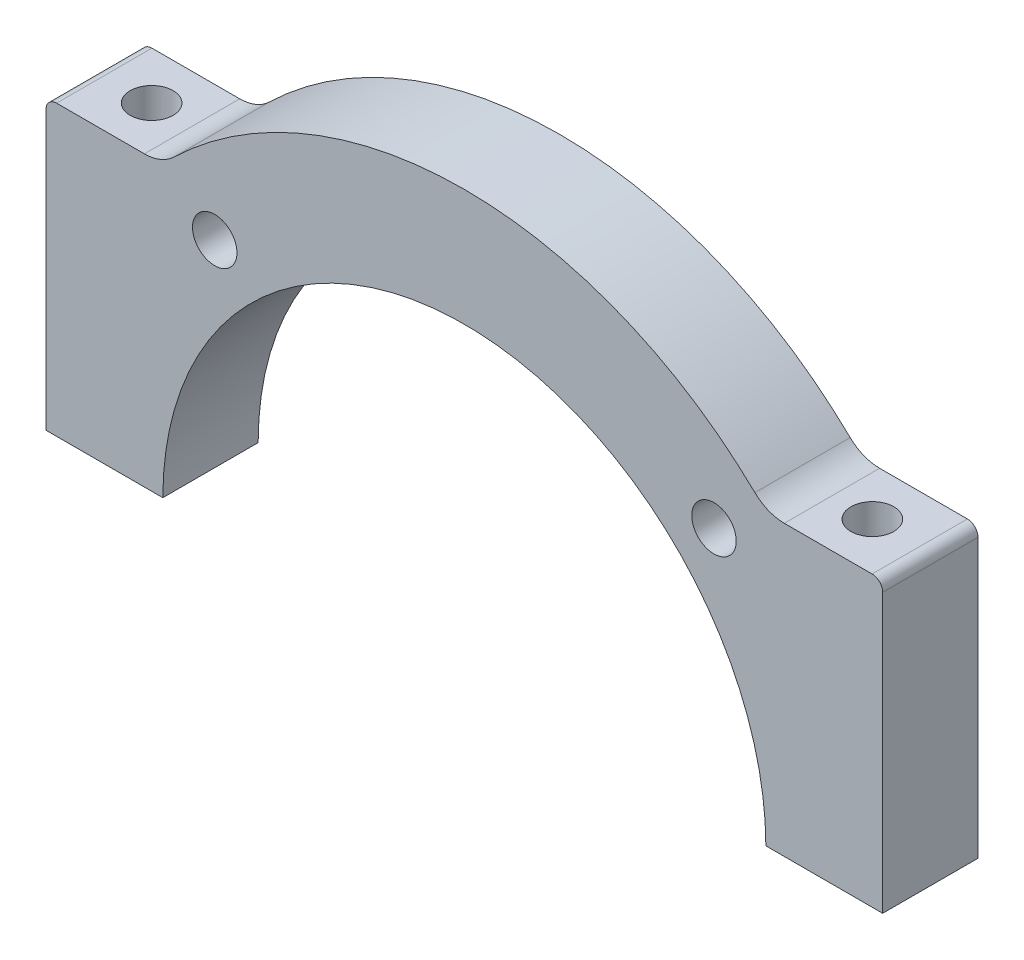
ISO-10303-21;
HEADER;
FILE_DESCRIPTION(('STEP AP214'),'2;1');
FILE_NAME('part.step','',(''),(''),'','','');
FILE_SCHEMA(('AUTOMOTIVE_DESIGN { 1 0 10303 214 1 1 1 1 }'));
ENDSEC;
DATA;
#1=APPLICATION_CONTEXT('core data for automotive mechanical design processes');
#2=APPLICATION_PROTOCOL_DEFINITION('international standard','automotive_design',2000,#1);
#3=PRODUCT_CONTEXT('',#1,'mechanical');
#4=PRODUCT('Part','Part','',(#3));
#5=PRODUCT_RELATED_PRODUCT_CATEGORY('part','',(#4));
#6=PRODUCT_DEFINITION_FORMATION('','',#4);
#7=PRODUCT_DEFINITION_CONTEXT('part definition',#1,'design');
#8=PRODUCT_DEFINITION('design','',#6,#7);
#9=PRODUCT_DEFINITION_SHAPE('','',#8);
#10=(LENGTH_UNIT() NAMED_UNIT(*) SI_UNIT(.MILLI.,.METRE.));
#11=(NAMED_UNIT(*) PLANE_ANGLE_UNIT() SI_UNIT($,.RADIAN.));
#12=(NAMED_UNIT(*) SI_UNIT($,.STERADIAN.) SOLID_ANGLE_UNIT());
#13=UNCERTAINTY_MEASURE_WITH_UNIT(LENGTH_MEASURE(1.E-05),#10,'distance_accuracy_value','');
#14=(GEOMETRIC_REPRESENTATION_CONTEXT(3) GLOBAL_UNCERTAINTY_ASSIGNED_CONTEXT((#13)) GLOBAL_UNIT_ASSIGNED_CONTEXT((#10,
#11,#12)) REPRESENTATION_CONTEXT('',''));
#15=CARTESIAN_POINT('',(0.,0.,0.));
#16=DIRECTION('',(0.,0.,1.));
#17=DIRECTION('',(1.,0.,0.));
#18=AXIS2_PLACEMENT_3D('',#15,#16,#17);
#19=CARTESIAN_POINT('',(-34.025,131.45295340565,4.5));
#20=DIRECTION('',(0.,-1.,0.));
#21=DIRECTION('',(1.,0.,0.));
#22=AXIS2_PLACEMENT_3D('',#19,#20,#21);
#23=CYLINDRICAL_SURFACE('',#22,2.025);
#24=CARTESIAN_POINT('',(-34.025,0.0499999999999945,4.5));
#25=DIRECTION('',(0.,-1.,0.));
#26=DIRECTION('',(0.,0.,1.));
#27=AXIS2_PLACEMENT_3D('',#24,#25,#26);
#28=CIRCLE('',#27,2.025);
#29=CARTESIAN_POINT('',(-34.025,0.0499999999999945,6.525));
#30=VERTEX_POINT('',#29);
#31=EDGE_CURVE('E222',#30,#30,#28,.T.);
#32=ORIENTED_EDGE('',*,*,#31,.T.);
#33=EDGE_LOOP('',(#32));
#34=FACE_BOUND('',#33,.T.);
#35=CARTESIAN_POINT('',(-34.025,27.2973899851249,4.5));
#36=DIRECTION('',(0.,-1.,0.));
#37=DIRECTION('',(0.,0.,1.));
#38=AXIS2_PLACEMENT_3D('',#35,#36,#37);
#39=CIRCLE('',#38,2.025);
#40=CARTESIAN_POINT('',(-34.025,27.2973899851249,6.525));
#41=VERTEX_POINT('',#40);
#42=EDGE_CURVE('E192',#41,#41,#39,.T.);
#43=ORIENTED_EDGE('',*,*,#42,.F.);
#44=EDGE_LOOP('',(#43));
#45=FACE_BOUND('',#44,.T.);
#46=ADVANCED_FACE('F16',(#34,#45),#23,.F.);
#47=CARTESIAN_POINT('',(34.025,131.45295340565,4.5));
#48=DIRECTION('',(0.,-1.,0.));
#49=DIRECTION('',(1.,0.,0.));
#50=AXIS2_PLACEMENT_3D('',#47,#48,#49);
#51=CYLINDRICAL_SURFACE('',#50,2.025);
#52=CARTESIAN_POINT('',(34.025,27.2973899851249,4.5));
#53=DIRECTION('',(0.,1.,0.));
#54=DIRECTION('',(0.,0.,-1.));
#55=AXIS2_PLACEMENT_3D('',#52,#53,#54);
#56=CIRCLE('',#55,2.025);
#57=CARTESIAN_POINT('',(34.025,27.2973899851249,2.475));
#58=VERTEX_POINT('',#57);
#59=EDGE_CURVE('E231',#58,#58,#56,.T.);
#60=ORIENTED_EDGE('',*,*,#59,.T.);
#61=EDGE_LOOP('',(#60));
#62=FACE_BOUND('',#61,.T.);
#63=CARTESIAN_POINT('',(34.025,0.0499999999999945,4.5));
#64=DIRECTION('',(0.,1.,0.));
#65=DIRECTION('',(1.,0.,0.));
#66=AXIS2_PLACEMENT_3D('',#63,#64,#65);
#67=CIRCLE('',#66,2.025);
#68=CARTESIAN_POINT('',(36.05,0.0499999999999948,4.5));
#69=VERTEX_POINT('',#68);
#70=EDGE_CURVE('E128',#69,#69,#67,.T.);
#71=ORIENTED_EDGE('',*,*,#70,.F.);
#72=EDGE_LOOP('',(#71));
#73=FACE_BOUND('',#72,.T.);
#74=ADVANCED_FACE('F459',(#62,#73),#51,.F.);
#75=CARTESIAN_POINT('',(0.,-12.25,0.));
#76=DIRECTION('',(0.,0.,1.));
#77=DIRECTION('',(1.,0.,0.));
#78=AXIS2_PLACEMENT_3D('',#75,#76,#77);
#79=PLANE('',#78);
#80=CARTESIAN_POINT('',(23.57,23.57,0.));
#81=DIRECTION('',(0.,0.,1.));
#82=DIRECTION('',(1.,0.,0.));
#83=AXIS2_PLACEMENT_3D('',#80,#81,#82);
#84=CIRCLE('',#83,2.1);
#85=CARTESIAN_POINT('',(25.67,23.57,0.));
#86=VERTEX_POINT('',#85);
#87=EDGE_CURVE('E11',#86,#86,#84,.T.);
#88=ORIENTED_EDGE('',*,*,#87,.T.);
#89=EDGE_LOOP('',(#88));
#90=FACE_BOUND('',#89,.T.);
#91=CARTESIAN_POINT('',(-23.57,23.57,0.));
#92=DIRECTION('',(0.,0.,1.));
#93=DIRECTION('',(1.,0.,0.));
#94=AXIS2_PLACEMENT_3D('',#91,#92,#93);
#95=CIRCLE('',#94,2.1);
#96=CARTESIAN_POINT('',(-21.47,23.57,0.));
#97=VERTEX_POINT('',#96);
#98=EDGE_CURVE('E211',#97,#97,#95,.T.);
#99=ORIENTED_EDGE('',*,*,#98,.T.);
#100=EDGE_LOOP('',(#99));
#101=FACE_BOUND('',#100,.T.);
#102=DIRECTION('',(-1.,0.,0.));
#103=VECTOR('',#102,1.);
#104=CARTESIAN_POINT('',(34.3556402380938,27.2973899851249,0.));
#105=LINE('',#104,#103);
#106=CARTESIAN_POINT('',(38.4999683544177,27.2973899851249,0.));
#107=VERTEX_POINT('',#106);
#108=CARTESIAN_POINT('',(30.2113121217699,27.2973899851249,0.));
#109=VERTEX_POINT('',#108);
#110=EDGE_CURVE('E234',#107,#109,#105,.T.);
#111=ORIENTED_EDGE('',*,*,#110,.F.);
#112=CARTESIAN_POINT('',(38.4999683544177,26.2973899851249,0.));
#113=DIRECTION('',(0.,0.,-1.));
#114=DIRECTION('',(1.,0.,0.));
#115=AXIS2_PLACEMENT_3D('',#112,#113,#114);
#116=CIRCLE('',#115,1.);
#117=CARTESIAN_POINT('',(39.4999683544177,26.2973899851249,0.));
#118=VERTEX_POINT('',#117);
#119=EDGE_CURVE('E216',#107,#118,#116,.T.);
#120=ORIENTED_EDGE('',*,*,#119,.T.);
#121=DIRECTION('',(0.,1.,0.));
#122=VECTOR('',#121,1.);
#123=CARTESIAN_POINT('',(39.4999683544177,13.1736949925625,0.));
#124=LINE('',#123,#122);
#125=CARTESIAN_POINT('',(39.4999683544177,0.050000000002007,0.));
#126=VERTEX_POINT('',#125);
#127=EDGE_CURVE('E288',#126,#118,#124,.T.);
#128=ORIENTED_EDGE('',*,*,#127,.F.);
#129=DIRECTION('',(-1.,0.,0.));
#130=VECTOR('',#129,1.);
#131=CARTESIAN_POINT('',(34.0249622857735,0.05,0.));
#132=LINE('',#131,#130);
#133=CARTESIAN_POINT('',(28.4699560940084,0.05,0.));
#134=VERTEX_POINT('',#133);
#135=EDGE_CURVE('E271',#126,#134,#132,.T.);
#136=ORIENTED_EDGE('',*,*,#135,.T.);
#137=CARTESIAN_POINT('',(-9.1919527545059E-11,0.,0.));
#138=DIRECTION('',(0.,0.,1.));
#139=DIRECTION('',(1.,0.,0.));
#140=AXIS2_PLACEMENT_3D('',#137,#138,#139);
#141=CIRCLE('',#140,28.47);
#142=CARTESIAN_POINT('',(-28.4699560941923,0.05,0.));
#143=VERTEX_POINT('',#142);
#144=EDGE_CURVE('E245',#134,#143,#141,.T.);
#145=ORIENTED_EDGE('',*,*,#144,.T.);
#146=DIRECTION('',(1.,0.,0.));
#147=VECTOR('',#146,1.);
#148=CARTESIAN_POINT('',(-34.0249622857735,0.05,0.));
#149=LINE('',#148,#147);
#150=CARTESIAN_POINT('',(-39.4999683544177,0.0499999999976821,0.));
#151=VERTEX_POINT('',#150);
#152=EDGE_CURVE('E217',#151,#143,#149,.T.);
#153=ORIENTED_EDGE('',*,*,#152,.F.);
#154=DIRECTION('',(0.,1.,0.));
#155=VECTOR('',#154,1.);
#156=CARTESIAN_POINT('',(-39.4999683544177,13.1736949925625,0.));
#157=LINE('',#156,#155);
#158=CARTESIAN_POINT('',(-39.4999683544177,26.2973899851249,0.));
#159=VERTEX_POINT('',#158);
#160=EDGE_CURVE('E223',#151,#159,#157,.T.);
#161=ORIENTED_EDGE('',*,*,#160,.T.);
#162=CARTESIAN_POINT('',(-38.4999683544177,26.2973899851249,0.));
#163=DIRECTION('',(0.,0.,1.));
#164=DIRECTION('',(1.,0.,0.));
#165=AXIS2_PLACEMENT_3D('',#162,#163,#164);
#166=CIRCLE('',#165,1.00000000000002);
#167=CARTESIAN_POINT('',(-38.4999683544177,27.2973899851249,0.));
#168=VERTEX_POINT('',#167);
#169=EDGE_CURVE('E180',#168,#159,#166,.T.);
#170=ORIENTED_EDGE('',*,*,#169,.F.);
#171=DIRECTION('',(1.,0.,0.));
#172=VECTOR('',#171,1.);
#173=CARTESIAN_POINT('',(-34.3556402380938,27.2973899851249,0.));
#174=LINE('',#173,#172);
#175=CARTESIAN_POINT('',(-30.2113121217699,27.2973899851249,0.));
#176=VERTEX_POINT('',#175);
#177=EDGE_CURVE('E274',#168,#176,#174,.T.);
#178=ORIENTED_EDGE('',*,*,#177,.T.);
#179=CARTESIAN_POINT('',(-30.2113121217699,31.2973899851249,0.));
#180=DIRECTION('',(0.,0.,1.));
#181=DIRECTION('',(1.,0.,0.));
#182=AXIS2_PLACEMENT_3D('',#179,#180,#181);
#183=CIRCLE('',#182,4.);
#184=CARTESIAN_POINT('',(-27.4332604324117,28.4194690669526,0.));
#185=VERTEX_POINT('',#184);
#186=EDGE_CURVE('E195',#176,#185,#183,.T.);
#187=ORIENTED_EDGE('',*,*,#186,.T.);
#188=CARTESIAN_POINT('',(0.,0.,0.));
#189=DIRECTION('',(0.,0.,1.));
#190=DIRECTION('',(1.,0.,0.));
#191=AXIS2_PLACEMENT_3D('',#188,#189,#190);
#192=CIRCLE('',#191,39.5);
#193=CARTESIAN_POINT('',(27.4332604324117,28.4194690669526,0.));
#194=VERTEX_POINT('',#193);
#195=EDGE_CURVE('E20',#194,#185,#192,.T.);
#196=ORIENTED_EDGE('',*,*,#195,.F.);
#197=CARTESIAN_POINT('',(30.2113121217699,31.2973899851249,0.));
#198=DIRECTION('',(0.,0.,-1.));
#199=DIRECTION('',(1.,0.,0.));
#200=AXIS2_PLACEMENT_3D('',#197,#198,#199);
#201=CIRCLE('',#200,4.);
#202=EDGE_CURVE('E240',#109,#194,#201,.T.);
#203=ORIENTED_EDGE('',*,*,#202,.F.);
#204=EDGE_LOOP('',(#111,#120,#128,#136,#145,#153,#161,#170,#178,#187,#196,#203));
#205=FACE_BOUND('',#204,.T.);
#206=ADVANCED_FACE('F310',(#90,#101,#205),#79,.F.);
#207=CARTESIAN_POINT('',(0.,-12.25,9.));
#208=DIRECTION('',(0.,0.,1.));
#209=DIRECTION('',(1.,0.,0.));
#210=AXIS2_PLACEMENT_3D('',#207,#208,#209);
#211=PLANE('',#210);
#212=CARTESIAN_POINT('',(23.57,23.57,9.));
#213=DIRECTION('',(0.,0.,1.));
#214=DIRECTION('',(1.,0.,0.));
#215=AXIS2_PLACEMENT_3D('',#212,#213,#214);
#216=CIRCLE('',#215,2.1);
#217=CARTESIAN_POINT('',(25.67,23.57,9.));
#218=VERTEX_POINT('',#217);
#219=EDGE_CURVE('E27',#218,#218,#216,.T.);
#220=ORIENTED_EDGE('',*,*,#219,.F.);
#221=EDGE_LOOP('',(#220));
#222=FACE_BOUND('',#221,.T.);
#223=CARTESIAN_POINT('',(-23.57,23.57,9.));
#224=DIRECTION('',(0.,0.,1.));
#225=DIRECTION('',(1.,0.,0.));
#226=AXIS2_PLACEMENT_3D('',#223,#224,#225);
#227=CIRCLE('',#226,2.1);
#228=CARTESIAN_POINT('',(-21.47,23.57,9.));
#229=VERTEX_POINT('',#228);
#230=EDGE_CURVE('E207',#229,#229,#227,.T.);
#231=ORIENTED_EDGE('',*,*,#230,.F.);
#232=EDGE_LOOP('',(#231));
#233=FACE_BOUND('',#232,.T.);
#234=DIRECTION('',(-1.,0.,0.));
#235=VECTOR('',#234,1.);
#236=CARTESIAN_POINT('',(34.3556402380938,27.2973899851249,9.));
#237=LINE('',#236,#235);
#238=CARTESIAN_POINT('',(38.4999683544177,27.2973899851249,9.));
#239=VERTEX_POINT('',#238);
#240=CARTESIAN_POINT('',(30.2113121217699,27.2973899851249,9.));
#241=VERTEX_POINT('',#240);
#242=EDGE_CURVE('E246',#239,#241,#237,.T.);
#243=ORIENTED_EDGE('',*,*,#242,.T.);
#244=CARTESIAN_POINT('',(30.2113121217699,31.2973899851249,9.));
#245=DIRECTION('',(0.,0.,-1.));
#246=DIRECTION('',(1.,0.,0.));
#247=AXIS2_PLACEMENT_3D('',#244,#245,#246);
#248=CIRCLE('',#247,4.);
#249=CARTESIAN_POINT('',(27.4332604324117,28.4194690669526,9.));
#250=VERTEX_POINT('',#249);
#251=EDGE_CURVE('E239',#241,#250,#248,.T.);
#252=ORIENTED_EDGE('',*,*,#251,.T.);
#253=CARTESIAN_POINT('',(0.,0.,9.));
#254=DIRECTION('',(0.,0.,1.));
#255=DIRECTION('',(1.,0.,0.));
#256=AXIS2_PLACEMENT_3D('',#253,#254,#255);
#257=CIRCLE('',#256,39.5);
#258=CARTESIAN_POINT('',(-27.4332604324117,28.4194690669526,9.));
#259=VERTEX_POINT('',#258);
#260=EDGE_CURVE('E187',#250,#259,#257,.T.);
#261=ORIENTED_EDGE('',*,*,#260,.T.);
#262=CARTESIAN_POINT('',(-30.2113121217699,31.2973899851249,9.));
#263=DIRECTION('',(0.,0.,1.));
#264=DIRECTION('',(1.,0.,0.));
#265=AXIS2_PLACEMENT_3D('',#262,#263,#264);
#266=CIRCLE('',#265,4.);
#267=CARTESIAN_POINT('',(-30.2113121217699,27.2973899851249,9.));
#268=VERTEX_POINT('',#267);
#269=EDGE_CURVE('E183',#268,#259,#266,.T.);
#270=ORIENTED_EDGE('',*,*,#269,.F.);
#271=DIRECTION('',(1.,0.,0.));
#272=VECTOR('',#271,1.);
#273=CARTESIAN_POINT('',(-34.3556402380938,27.2973899851249,9.));
#274=LINE('',#273,#272);
#275=CARTESIAN_POINT('',(-38.4999683544177,27.2973899851249,9.));
#276=VERTEX_POINT('',#275);
#277=EDGE_CURVE('E167',#276,#268,#274,.T.);
#278=ORIENTED_EDGE('',*,*,#277,.F.);
#279=CARTESIAN_POINT('',(-38.4999683544177,26.2973899851249,9.));
#280=DIRECTION('',(0.,0.,1.));
#281=DIRECTION('',(1.,0.,0.));
#282=AXIS2_PLACEMENT_3D('',#279,#280,#281);
#283=CIRCLE('',#282,1.00000000000002);
#284=CARTESIAN_POINT('',(-39.4999683544177,26.2973899851249,9.));
#285=VERTEX_POINT('',#284);
#286=EDGE_CURVE('E227',#276,#285,#283,.T.);
#287=ORIENTED_EDGE('',*,*,#286,.T.);
#288=DIRECTION('',(0.,1.,0.));
#289=VECTOR('',#288,1.);
#290=CARTESIAN_POINT('',(-39.4999683544177,13.1736949925625,9.));
#291=LINE('',#290,#289);
#292=CARTESIAN_POINT('',(-39.4999683544177,0.0499999999976821,9.));
#293=VERTEX_POINT('',#292);
#294=EDGE_CURVE('E230',#293,#285,#291,.T.);
#295=ORIENTED_EDGE('',*,*,#294,.F.);
#296=DIRECTION('',(1.,0.,0.));
#297=VECTOR('',#296,1.);
#298=CARTESIAN_POINT('',(-34.0249622857735,0.05,9.));
#299=LINE('',#298,#297);
#300=CARTESIAN_POINT('',(-28.4699560941923,0.05,9.));
#301=VERTEX_POINT('',#300);
#302=EDGE_CURVE('E254',#293,#301,#299,.T.);
#303=ORIENTED_EDGE('',*,*,#302,.T.);
#304=CARTESIAN_POINT('',(-9.1919527545059E-11,0.,9.));
#305=DIRECTION('',(0.,0.,1.));
#306=DIRECTION('',(1.,0.,0.));
#307=AXIS2_PLACEMENT_3D('',#304,#305,#306);
#308=CIRCLE('',#307,28.47);
#309=CARTESIAN_POINT('',(28.4699560940084,0.05,9.));
#310=VERTEX_POINT('',#309);
#311=EDGE_CURVE('E244',#310,#301,#308,.T.);
#312=ORIENTED_EDGE('',*,*,#311,.F.);
#313=DIRECTION('',(-1.,0.,0.));
#314=VECTOR('',#313,1.);
#315=CARTESIAN_POINT('',(34.0249622857735,0.05,9.));
#316=LINE('',#315,#314);
#317=CARTESIAN_POINT('',(39.4999683544177,0.050000000002007,9.));
#318=VERTEX_POINT('',#317);
#319=EDGE_CURVE('E141',#318,#310,#316,.T.);
#320=ORIENTED_EDGE('',*,*,#319,.F.);
#321=DIRECTION('',(0.,1.,0.));
#322=VECTOR('',#321,1.);
#323=CARTESIAN_POINT('',(39.4999683544177,13.1736949925625,9.));
#324=LINE('',#323,#322);
#325=CARTESIAN_POINT('',(39.4999683544177,26.2973899851249,9.));
#326=VERTEX_POINT('',#325);
#327=EDGE_CURVE('E212',#318,#326,#324,.T.);
#328=ORIENTED_EDGE('',*,*,#327,.T.);
#329=CARTESIAN_POINT('',(38.4999683544177,26.2973899851249,9.));
#330=DIRECTION('',(0.,0.,-1.));
#331=DIRECTION('',(1.,0.,0.));
#332=AXIS2_PLACEMENT_3D('',#329,#330,#331);
#333=CIRCLE('',#332,1.);
#334=EDGE_CURVE('E286',#239,#326,#333,.T.);
#335=ORIENTED_EDGE('',*,*,#334,.F.);
#336=EDGE_LOOP('',(#243,#252,#261,#270,#278,#287,#295,#303,#312,#320,#328,#335));
#337=FACE_BOUND('',#336,.T.);
#338=ADVANCED_FACE('F185',(#222,#233,#337),#211,.T.);
#339=CARTESIAN_POINT('',(23.57,23.57,9.));
#340=DIRECTION('',(0.,0.,-1.));
#341=DIRECTION('',(-1.,0.,0.));
#342=AXIS2_PLACEMENT_3D('',#339,#340,#341);
#343=CYLINDRICAL_SURFACE('',#342,2.1);
#344=ORIENTED_EDGE('',*,*,#87,.F.);
#345=EDGE_LOOP('',(#344));
#346=FACE_BOUND('',#345,.T.);
#347=ORIENTED_EDGE('',*,*,#219,.T.);
#348=EDGE_LOOP('',(#347));
#349=FACE_BOUND('',#348,.T.);
#350=ADVANCED_FACE('F480',(#346,#349),#343,.F.);
#351=CARTESIAN_POINT('',(38.4999683544177,26.2973899851249,9.));
#352=DIRECTION('',(0.,0.,-1.));
#353=DIRECTION('',(-1.,0.,0.));
#354=AXIS2_PLACEMENT_3D('',#351,#352,#353);
#355=CYLINDRICAL_SURFACE('',#354,1.);
#356=ORIENTED_EDGE('',*,*,#119,.F.);
#357=DIRECTION('',(0.,0.,-1.));
#358=VECTOR('',#357,1.);
#359=CARTESIAN_POINT('',(38.4999683544177,27.2973899851249,9.));
#360=LINE('',#359,#358);
#361=EDGE_CURVE('E249',#239,#107,#360,.T.);
#362=ORIENTED_EDGE('',*,*,#361,.F.);
#363=ORIENTED_EDGE('',*,*,#334,.T.);
#364=DIRECTION('',(0.,0.,-1.));
#365=VECTOR('',#364,1.);
#366=CARTESIAN_POINT('',(39.4999683544177,26.2973899851249,9.));
#367=LINE('',#366,#365);
#368=EDGE_CURVE('E278',#326,#118,#367,.T.);
#369=ORIENTED_EDGE('',*,*,#368,.T.);
#370=EDGE_LOOP('',(#356,#362,#363,#369));
#371=FACE_BOUND('',#370,.T.);
#372=ADVANCED_FACE('F443',(#371),#355,.T.);
#373=CARTESIAN_POINT('',(-23.57,23.57,9.));
#374=DIRECTION('',(0.,0.,-1.));
#375=DIRECTION('',(-1.,0.,0.));
#376=AXIS2_PLACEMENT_3D('',#373,#374,#375);
#377=CYLINDRICAL_SURFACE('',#376,2.1);
#378=ORIENTED_EDGE('',*,*,#98,.F.);
#379=EDGE_LOOP('',(#378));
#380=FACE_BOUND('',#379,.T.);
#381=ORIENTED_EDGE('',*,*,#230,.T.);
#382=EDGE_LOOP('',(#381));
#383=FACE_BOUND('',#382,.T.);
#384=ADVANCED_FACE('F454',(#380,#383),#377,.F.);
#385=CARTESIAN_POINT('',(39.4999683544177,13.1736949925625,9.));
#386=DIRECTION('',(-1.,0.,0.));
#387=DIRECTION('',(0.,0.,1.));
#388=AXIS2_PLACEMENT_3D('',#385,#386,#387);
#389=PLANE('',#388);
#390=ORIENTED_EDGE('',*,*,#127,.T.);
#391=ORIENTED_EDGE('',*,*,#368,.F.);
#392=ORIENTED_EDGE('',*,*,#327,.F.);
#393=DIRECTION('',(0.,0.,-1.));
#394=VECTOR('',#393,1.);
#395=CARTESIAN_POINT('',(39.4999683544177,0.050000000002007,9.));
#396=LINE('',#395,#394);
#397=EDGE_CURVE('E267',#318,#126,#396,.T.);
#398=ORIENTED_EDGE('',*,*,#397,.T.);
#399=EDGE_LOOP('',(#390,#391,#392,#398));
#400=FACE_BOUND('',#399,.T.);
#401=ADVANCED_FACE('F446',(#400),#389,.F.);
#402=CARTESIAN_POINT('',(34.0249622857735,0.05,9.));
#403=DIRECTION('',(0.,-1.,0.));
#404=DIRECTION('',(0.,0.,-1.));
#405=AXIS2_PLACEMENT_3D('',#402,#403,#404);
#406=PLANE('',#405);
#407=ORIENTED_EDGE('',*,*,#135,.F.);
#408=ORIENTED_EDGE('',*,*,#397,.F.);
#409=ORIENTED_EDGE('',*,*,#319,.T.);
#410=DIRECTION('',(0.,0.,-1.));
#411=VECTOR('',#410,1.);
#412=CARTESIAN_POINT('',(28.4699560940084,0.05,9.));
#413=LINE('',#412,#411);
#414=EDGE_CURVE('E241',#310,#134,#413,.T.);
#415=ORIENTED_EDGE('',*,*,#414,.T.);
#416=EDGE_LOOP('',(#407,#408,#409,#415));
#417=FACE_BOUND('',#416,.T.);
#418=ORIENTED_EDGE('',*,*,#70,.T.);
#419=EDGE_LOOP('',(#418));
#420=FACE_BOUND('',#419,.T.);
#421=ADVANCED_FACE('F447',(#417,#420),#406,.T.);
#422=CARTESIAN_POINT('',(-9.1919527545059E-11,0.,9.));
#423=DIRECTION('',(0.,0.,-1.));
#424=DIRECTION('',(-1.,0.,0.));
#425=AXIS2_PLACEMENT_3D('',#422,#423,#424);
#426=CYLINDRICAL_SURFACE('',#425,28.47);
#427=ORIENTED_EDGE('',*,*,#144,.F.);
#428=ORIENTED_EDGE('',*,*,#414,.F.);
#429=ORIENTED_EDGE('',*,*,#311,.T.);
#430=DIRECTION('',(0.,0.,-1.));
#431=VECTOR('',#430,1.);
#432=CARTESIAN_POINT('',(-28.4699560941923,0.05,9.));
#433=LINE('',#432,#431);
#434=EDGE_CURVE('E221',#301,#143,#433,.T.);
#435=ORIENTED_EDGE('',*,*,#434,.T.);
#436=EDGE_LOOP('',(#427,#428,#429,#435));
#437=FACE_BOUND('',#436,.T.);
#438=ADVANCED_FACE('F18',(#437),#426,.F.);
#439=CARTESIAN_POINT('',(-34.0249622857735,0.05,9.));
#440=DIRECTION('',(0.,1.,0.));
#441=DIRECTION('',(1.,0.,0.));
#442=AXIS2_PLACEMENT_3D('',#439,#440,#441);
#443=PLANE('',#442);
#444=ORIENTED_EDGE('',*,*,#152,.T.);
#445=ORIENTED_EDGE('',*,*,#434,.F.);
#446=ORIENTED_EDGE('',*,*,#302,.F.);
#447=DIRECTION('',(0.,0.,-1.));
#448=VECTOR('',#447,1.);
#449=CARTESIAN_POINT('',(-39.4999683544177,0.0499999999976821,9.));
#450=LINE('',#449,#448);
#451=EDGE_CURVE('E226',#293,#151,#450,.T.);
#452=ORIENTED_EDGE('',*,*,#451,.T.);
#453=EDGE_LOOP('',(#444,#445,#446,#452));
#454=FACE_BOUND('',#453,.T.);
#455=ORIENTED_EDGE('',*,*,#31,.F.);
#456=EDGE_LOOP('',(#455));
#457=FACE_BOUND('',#456,.T.);
#458=ADVANCED_FACE('F304',(#454,#457),#443,.F.);
#459=CARTESIAN_POINT('',(-39.4999683544177,13.1736949925625,9.));
#460=DIRECTION('',(-1.,0.,0.));
#461=DIRECTION('',(0.,0.,1.));
#462=AXIS2_PLACEMENT_3D('',#459,#460,#461);
#463=PLANE('',#462);
#464=ORIENTED_EDGE('',*,*,#160,.F.);
#465=ORIENTED_EDGE('',*,*,#451,.F.);
#466=ORIENTED_EDGE('',*,*,#294,.T.);
#467=DIRECTION('',(0.,0.,-1.));
#468=VECTOR('',#467,1.);
#469=CARTESIAN_POINT('',(-39.4999683544177,26.2973899851249,9.));
#470=LINE('',#469,#468);
#471=EDGE_CURVE('E261',#285,#159,#470,.T.);
#472=ORIENTED_EDGE('',*,*,#471,.T.);
#473=EDGE_LOOP('',(#464,#465,#466,#472));
#474=FACE_BOUND('',#473,.T.);
#475=ADVANCED_FACE('F478',(#474),#463,.T.);
#476=CARTESIAN_POINT('',(-38.4999683544177,26.2973899851249,9.));
#477=DIRECTION('',(0.,0.,-1.));
#478=DIRECTION('',(-1.,0.,0.));
#479=AXIS2_PLACEMENT_3D('',#476,#477,#478);
#480=CYLINDRICAL_SURFACE('',#479,1.00000000000002);
#481=ORIENTED_EDGE('',*,*,#169,.T.);
#482=ORIENTED_EDGE('',*,*,#471,.F.);
#483=ORIENTED_EDGE('',*,*,#286,.F.);
#484=DIRECTION('',(0.,0.,-1.));
#485=VECTOR('',#484,1.);
#486=CARTESIAN_POINT('',(-38.4999683544177,27.2973899851249,9.));
#487=LINE('',#486,#485);
#488=EDGE_CURVE('E176',#276,#168,#487,.T.);
#489=ORIENTED_EDGE('',*,*,#488,.T.);
#490=EDGE_LOOP('',(#481,#482,#483,#489));
#491=FACE_BOUND('',#490,.T.);
#492=ADVANCED_FACE('F430',(#491),#480,.T.);
#493=CARTESIAN_POINT('',(-34.3556402380938,27.2973899851249,9.));
#494=DIRECTION('',(0.,1.,0.));
#495=DIRECTION('',(1.,0.,0.));
#496=AXIS2_PLACEMENT_3D('',#493,#494,#495);
#497=PLANE('',#496);
#498=ORIENTED_EDGE('',*,*,#177,.F.);
#499=ORIENTED_EDGE('',*,*,#488,.F.);
#500=ORIENTED_EDGE('',*,*,#277,.T.);
#501=DIRECTION('',(0.,0.,-1.));
#502=VECTOR('',#501,1.);
#503=CARTESIAN_POINT('',(-30.2113121217699,27.2973899851249,9.));
#504=LINE('',#503,#502);
#505=EDGE_CURVE('E173',#268,#176,#504,.T.);
#506=ORIENTED_EDGE('',*,*,#505,.T.);
#507=EDGE_LOOP('',(#498,#499,#500,#506));
#508=FACE_BOUND('',#507,.T.);
#509=ORIENTED_EDGE('',*,*,#42,.T.);
#510=EDGE_LOOP('',(#509));
#511=FACE_BOUND('',#510,.T.);
#512=ADVANCED_FACE('F170',(#508,#511),#497,.T.);
#513=CARTESIAN_POINT('',(-30.2113121217699,31.2973899851249,9.));
#514=DIRECTION('',(0.,0.,-1.));
#515=DIRECTION('',(-1.,0.,0.));
#516=AXIS2_PLACEMENT_3D('',#513,#514,#515);
#517=CYLINDRICAL_SURFACE('',#516,4.);
#518=ORIENTED_EDGE('',*,*,#186,.F.);
#519=ORIENTED_EDGE('',*,*,#505,.F.);
#520=ORIENTED_EDGE('',*,*,#269,.T.);
#521=DIRECTION('',(0.,0.,-1.));
#522=VECTOR('',#521,1.);
#523=CARTESIAN_POINT('',(-27.4332604324117,28.4194690669526,9.));
#524=LINE('',#523,#522);
#525=EDGE_CURVE('E251',#259,#185,#524,.T.);
#526=ORIENTED_EDGE('',*,*,#525,.T.);
#527=EDGE_LOOP('',(#518,#519,#520,#526));
#528=FACE_BOUND('',#527,.T.);
#529=ADVANCED_FACE('F194',(#528),#517,.F.);
#530=CARTESIAN_POINT('',(0.,0.,9.));
#531=DIRECTION('',(0.,0.,-1.));
#532=DIRECTION('',(-1.,0.,0.));
#533=AXIS2_PLACEMENT_3D('',#530,#531,#532);
#534=CYLINDRICAL_SURFACE('',#533,39.5);
#535=ORIENTED_EDGE('',*,*,#195,.T.);
#536=ORIENTED_EDGE('',*,*,#525,.F.);
#537=ORIENTED_EDGE('',*,*,#260,.F.);
#538=DIRECTION('',(0.,0.,-1.));
#539=VECTOR('',#538,1.);
#540=CARTESIAN_POINT('',(27.4332604324117,28.4194690669526,9.));
#541=LINE('',#540,#539);
#542=EDGE_CURVE('E235',#250,#194,#541,.T.);
#543=ORIENTED_EDGE('',*,*,#542,.T.);
#544=EDGE_LOOP('',(#535,#536,#537,#543));
#545=FACE_BOUND('',#544,.T.);
#546=ADVANCED_FACE('F432',(#545),#534,.T.);
#547=CARTESIAN_POINT('',(30.2113121217699,31.2973899851249,9.));
#548=DIRECTION('',(0.,0.,-1.));
#549=DIRECTION('',(-1.,0.,0.));
#550=AXIS2_PLACEMENT_3D('',#547,#548,#549);
#551=CYLINDRICAL_SURFACE('',#550,4.);
#552=ORIENTED_EDGE('',*,*,#202,.T.);
#553=ORIENTED_EDGE('',*,*,#542,.F.);
#554=ORIENTED_EDGE('',*,*,#251,.F.);
#555=DIRECTION('',(0.,0.,-1.));
#556=VECTOR('',#555,1.);
#557=CARTESIAN_POINT('',(30.2113121217699,27.2973899851249,9.));
#558=LINE('',#557,#556);
#559=EDGE_CURVE('E250',#241,#109,#558,.T.);
#560=ORIENTED_EDGE('',*,*,#559,.T.);
#561=EDGE_LOOP('',(#552,#553,#554,#560));
#562=FACE_BOUND('',#561,.T.);
#563=ADVANCED_FACE('F435',(#562),#551,.F.);
#564=CARTESIAN_POINT('',(34.3556402380938,27.2973899851249,9.));
#565=DIRECTION('',(0.,-1.,0.));
#566=DIRECTION('',(0.,0.,-1.));
#567=AXIS2_PLACEMENT_3D('',#564,#565,#566);
#568=PLANE('',#567);
#569=ORIENTED_EDGE('',*,*,#110,.T.);
#570=ORIENTED_EDGE('',*,*,#559,.F.);
#571=ORIENTED_EDGE('',*,*,#242,.F.);
#572=ORIENTED_EDGE('',*,*,#361,.T.);
#573=EDGE_LOOP('',(#569,#570,#571,#572));
#574=FACE_BOUND('',#573,.T.);
#575=ORIENTED_EDGE('',*,*,#59,.F.);
#576=EDGE_LOOP('',(#575));
#577=FACE_BOUND('',#576,.T.);
#578=ADVANCED_FACE('F438',(#574,#577),#568,.F.);
#579=CLOSED_SHELL('',(#46,#74,#206,#338,#350,#372,#384,#401,#421,#438,#458,#475,#492,#512,#529,
#546,#563,#578));
#580=MANIFOLD_SOLID_BREP('B1',#579);
#581=ADVANCED_BREP_SHAPE_REPRESENTATION('',(#18,#580),#14);
#582=SHAPE_DEFINITION_REPRESENTATION(#9,#581);
ENDSEC;
END-ISO-10303-21;
